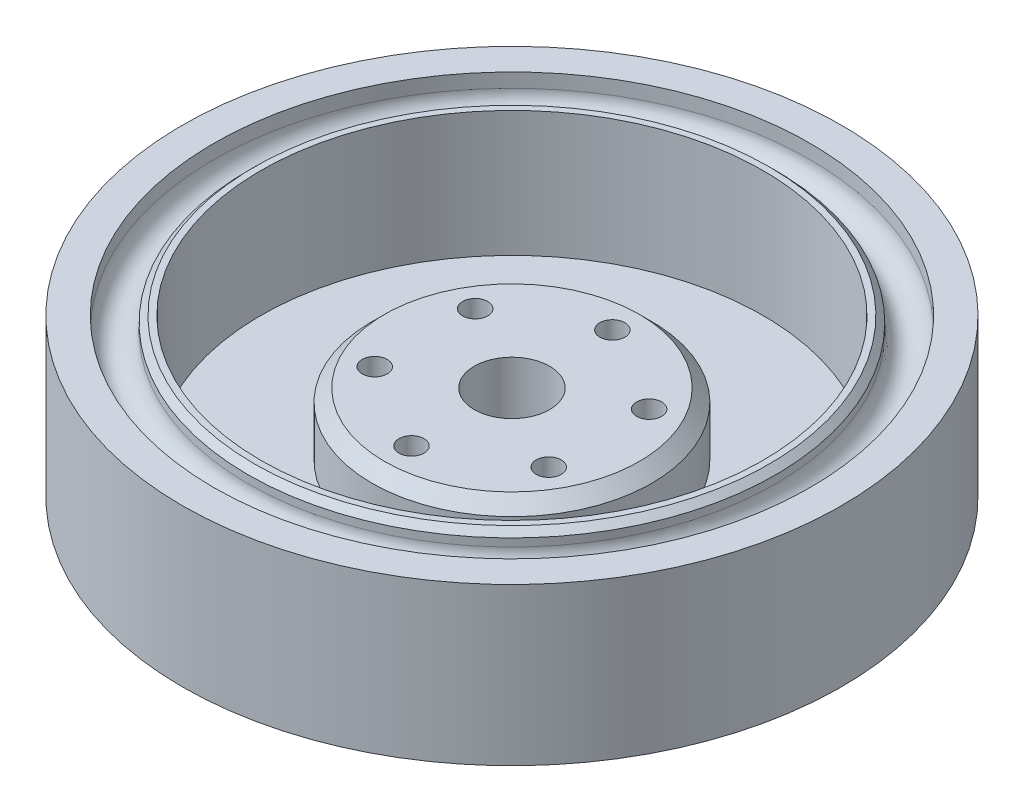
ISO-10303-21;
HEADER;
FILE_DESCRIPTION(('STEP AP214'),'2;1');
FILE_NAME('part.step','',(''),(''),'','','');
FILE_SCHEMA(('AUTOMOTIVE_DESIGN { 1 0 10303 214 1 1 1 1 }'));
ENDSEC;
DATA;
#1=APPLICATION_CONTEXT('core data for automotive mechanical design processes');
#2=APPLICATION_PROTOCOL_DEFINITION('international standard','automotive_design',2000,#1);
#3=PRODUCT_CONTEXT('',#1,'mechanical');
#4=PRODUCT('Part','Part','',(#3));
#5=PRODUCT_RELATED_PRODUCT_CATEGORY('part','',(#4));
#6=PRODUCT_DEFINITION_FORMATION('','',#4);
#7=PRODUCT_DEFINITION_CONTEXT('part definition',#1,'design');
#8=PRODUCT_DEFINITION('design','',#6,#7);
#9=PRODUCT_DEFINITION_SHAPE('','',#8);
#10=(LENGTH_UNIT() NAMED_UNIT(*) SI_UNIT(.MILLI.,.METRE.));
#11=(NAMED_UNIT(*) PLANE_ANGLE_UNIT() SI_UNIT($,.RADIAN.));
#12=(NAMED_UNIT(*) SI_UNIT($,.STERADIAN.) SOLID_ANGLE_UNIT());
#13=UNCERTAINTY_MEASURE_WITH_UNIT(LENGTH_MEASURE(1.E-05),#10,'distance_accuracy_value','');
#14=(GEOMETRIC_REPRESENTATION_CONTEXT(3) GLOBAL_UNCERTAINTY_ASSIGNED_CONTEXT((#13)) GLOBAL_UNIT_ASSIGNED_CONTEXT((#10,
#11,#12)) REPRESENTATION_CONTEXT('',''));
#15=CARTESIAN_POINT('',(0.,0.,0.));
#16=DIRECTION('',(0.,0.,1.));
#17=DIRECTION('',(1.,0.,0.));
#18=AXIS2_PLACEMENT_3D('',#15,#16,#17);
#19=CARTESIAN_POINT('',(-13.8564064605509,-0.000999999999999265,-8.00000000000016));
#20=DIRECTION('',(0.,1.,0.));
#21=DIRECTION('',(0.,0.,1.));
#22=AXIS2_PLACEMENT_3D('',#19,#20,#21);
#23=CYLINDRICAL_SURFACE('',#22,2.);
#24=CARTESIAN_POINT('',(-13.8564064605509,15.,-8.00000000000016));
#25=DIRECTION('',(0.,1.,0.));
#26=DIRECTION('',(0.,0.,1.));
#27=AXIS2_PLACEMENT_3D('',#24,#25,#26);
#28=CIRCLE('',#27,2.);
#29=CARTESIAN_POINT('',(-13.8564064605509,15.,-6.00000000000016));
#30=VERTEX_POINT('',#29);
#31=EDGE_CURVE('E79',#30,#30,#28,.T.);
#32=ORIENTED_EDGE('',*,*,#31,.T.);
#33=EDGE_LOOP('',(#32));
#34=FACE_BOUND('',#33,.T.);
#35=CARTESIAN_POINT('',(-13.8564064605509,5.,-8.00000000000016));
#36=DIRECTION('',(0.,-1.,0.));
#37=DIRECTION('',(0.,0.,-1.));
#38=AXIS2_PLACEMENT_3D('',#35,#36,#37);
#39=CIRCLE('',#38,2.);
#40=CARTESIAN_POINT('',(-13.8564064605509,5.,-10.0000000000002));
#41=VERTEX_POINT('',#40);
#42=EDGE_CURVE('E45',#41,#41,#39,.F.);
#43=ORIENTED_EDGE('',*,*,#42,.F.);
#44=EDGE_LOOP('',(#43));
#45=FACE_BOUND('',#44,.T.);
#46=ADVANCED_FACE('F40',(#34,#45),#23,.F.);
#47=CARTESIAN_POINT('',(-13.8564064605511,-0.000999999999999265,7.99999999999987));
#48=DIRECTION('',(0.,1.,0.));
#49=DIRECTION('',(0.,0.,1.));
#50=AXIS2_PLACEMENT_3D('',#47,#48,#49);
#51=CYLINDRICAL_SURFACE('',#50,2.);
#52=CARTESIAN_POINT('',(-13.8564064605511,15.,7.99999999999987));
#53=DIRECTION('',(0.,1.,0.));
#54=DIRECTION('',(0.,0.,1.));
#55=AXIS2_PLACEMENT_3D('',#52,#53,#54);
#56=CIRCLE('',#55,2.);
#57=CARTESIAN_POINT('',(-13.8564064605511,15.,9.99999999999987));
#58=VERTEX_POINT('',#57);
#59=EDGE_CURVE('E84',#58,#58,#56,.T.);
#60=ORIENTED_EDGE('',*,*,#59,.T.);
#61=EDGE_LOOP('',(#60));
#62=FACE_BOUND('',#61,.T.);
#63=CARTESIAN_POINT('',(-13.8564064605511,5.,7.99999999999987));
#64=DIRECTION('',(0.,-1.,0.));
#65=DIRECTION('',(0.,0.,-1.));
#66=AXIS2_PLACEMENT_3D('',#63,#64,#65);
#67=CIRCLE('',#66,2.);
#68=CARTESIAN_POINT('',(-13.8564064605511,5.,5.99999999999987));
#69=VERTEX_POINT('',#68);
#70=EDGE_CURVE('E70',#69,#69,#67,.F.);
#71=ORIENTED_EDGE('',*,*,#70,.F.);
#72=EDGE_LOOP('',(#71));
#73=FACE_BOUND('',#72,.T.);
#74=ADVANCED_FACE('F160',(#62,#73),#51,.F.);
#75=CARTESIAN_POINT('',(13.856406460551,-0.000999999999999265,-7.99999999999997));
#76=DIRECTION('',(0.,1.,0.));
#77=DIRECTION('',(0.,0.,1.));
#78=AXIS2_PLACEMENT_3D('',#75,#76,#77);
#79=CYLINDRICAL_SURFACE('',#78,2.);
#80=CARTESIAN_POINT('',(13.856406460551,15.,-7.99999999999997));
#81=DIRECTION('',(0.,1.,0.));
#82=DIRECTION('',(0.,0.,1.));
#83=AXIS2_PLACEMENT_3D('',#80,#81,#82);
#84=CIRCLE('',#83,2.);
#85=CARTESIAN_POINT('',(13.856406460551,15.,-5.99999999999997));
#86=VERTEX_POINT('',#85);
#87=EDGE_CURVE('E98',#86,#86,#84,.T.);
#88=ORIENTED_EDGE('',*,*,#87,.T.);
#89=EDGE_LOOP('',(#88));
#90=FACE_BOUND('',#89,.T.);
#91=CARTESIAN_POINT('',(13.856406460551,5.,-7.99999999999997));
#92=DIRECTION('',(0.,-1.,0.));
#93=DIRECTION('',(0.,0.,-1.));
#94=AXIS2_PLACEMENT_3D('',#91,#92,#93);
#95=CIRCLE('',#94,2.);
#96=CARTESIAN_POINT('',(13.856406460551,5.,-9.99999999999997));
#97=VERTEX_POINT('',#96);
#98=EDGE_CURVE('E68',#97,#97,#95,.F.);
#99=ORIENTED_EDGE('',*,*,#98,.F.);
#100=EDGE_LOOP('',(#99));
#101=FACE_BOUND('',#100,.T.);
#102=ADVANCED_FACE('F167',(#90,#101),#79,.F.);
#103=CARTESIAN_POINT('',(13.856406460551,-0.000999999999999265,8.00000000000007));
#104=DIRECTION('',(0.,1.,0.));
#105=DIRECTION('',(0.,0.,1.));
#106=AXIS2_PLACEMENT_3D('',#103,#104,#105);
#107=CYLINDRICAL_SURFACE('',#106,2.);
#108=CARTESIAN_POINT('',(13.856406460551,15.,8.00000000000007));
#109=DIRECTION('',(0.,1.,0.));
#110=DIRECTION('',(0.,0.,1.));
#111=AXIS2_PLACEMENT_3D('',#108,#109,#110);
#112=CIRCLE('',#111,2.);
#113=CARTESIAN_POINT('',(13.856406460551,15.,10.0000000000001));
#114=VERTEX_POINT('',#113);
#115=EDGE_CURVE('E95',#114,#114,#112,.T.);
#116=ORIENTED_EDGE('',*,*,#115,.T.);
#117=EDGE_LOOP('',(#116));
#118=FACE_BOUND('',#117,.T.);
#119=CARTESIAN_POINT('',(13.856406460551,5.,8.00000000000007));
#120=DIRECTION('',(0.,-1.,0.));
#121=DIRECTION('',(0.,0.,-1.));
#122=AXIS2_PLACEMENT_3D('',#119,#120,#121);
#123=CIRCLE('',#122,2.);
#124=CARTESIAN_POINT('',(13.856406460551,5.,6.00000000000006));
#125=VERTEX_POINT('',#124);
#126=EDGE_CURVE('E65',#125,#125,#123,.F.);
#127=ORIENTED_EDGE('',*,*,#126,.F.);
#128=EDGE_LOOP('',(#127));
#129=FACE_BOUND('',#128,.T.);
#130=ADVANCED_FACE('F227',(#118,#129),#107,.F.);
#131=CARTESIAN_POINT('',(-1.1172740284298E-13,-0.000999999999999265,16.));
#132=DIRECTION('',(0.,1.,0.));
#133=DIRECTION('',(0.,0.,1.));
#134=AXIS2_PLACEMENT_3D('',#131,#132,#133);
#135=CYLINDRICAL_SURFACE('',#134,2.);
#136=CARTESIAN_POINT('',(-1.1172740284298E-13,15.,16.));
#137=DIRECTION('',(0.,1.,0.));
#138=DIRECTION('',(0.,0.,1.));
#139=AXIS2_PLACEMENT_3D('',#136,#137,#138);
#140=CIRCLE('',#139,2.);
#141=CARTESIAN_POINT('',(-1.1172740284298E-13,15.,18.));
#142=VERTEX_POINT('',#141);
#143=EDGE_CURVE('E99',#142,#142,#140,.T.);
#144=ORIENTED_EDGE('',*,*,#143,.T.);
#145=EDGE_LOOP('',(#144));
#146=FACE_BOUND('',#145,.T.);
#147=CARTESIAN_POINT('',(-1.1172740284298E-13,5.,16.));
#148=DIRECTION('',(0.,-1.,0.));
#149=DIRECTION('',(0.,0.,-1.));
#150=AXIS2_PLACEMENT_3D('',#147,#148,#149);
#151=CIRCLE('',#150,2.);
#152=CARTESIAN_POINT('',(-1.1172740284298E-13,5.,14.));
#153=VERTEX_POINT('',#152);
#154=EDGE_CURVE('E61',#153,#153,#151,.F.);
#155=ORIENTED_EDGE('',*,*,#154,.F.);
#156=EDGE_LOOP('',(#155));
#157=FACE_BOUND('',#156,.T.);
#158=ADVANCED_FACE('F153',(#146,#157),#135,.F.);
#159=CARTESIAN_POINT('',(0.,-0.000999999999999265,-16.));
#160=DIRECTION('',(0.,1.,0.));
#161=DIRECTION('',(0.,0.,1.));
#162=AXIS2_PLACEMENT_3D('',#159,#160,#161);
#163=CYLINDRICAL_SURFACE('',#162,2.);
#164=CARTESIAN_POINT('',(0.,15.,-16.));
#165=DIRECTION('',(0.,1.,0.));
#166=DIRECTION('',(0.,0.,1.));
#167=AXIS2_PLACEMENT_3D('',#164,#165,#166);
#168=CIRCLE('',#167,2.);
#169=CARTESIAN_POINT('',(0.,15.,-14.));
#170=VERTEX_POINT('',#169);
#171=EDGE_CURVE('E90',#170,#170,#168,.T.);
#172=ORIENTED_EDGE('',*,*,#171,.T.);
#173=EDGE_LOOP('',(#172));
#174=FACE_BOUND('',#173,.T.);
#175=CARTESIAN_POINT('',(0.,5.,-16.));
#176=DIRECTION('',(0.,-1.,0.));
#177=DIRECTION('',(0.,0.,-1.));
#178=AXIS2_PLACEMENT_3D('',#175,#176,#177);
#179=CIRCLE('',#178,2.);
#180=CARTESIAN_POINT('',(0.,5.,-18.));
#181=VERTEX_POINT('',#180);
#182=EDGE_CURVE('E58',#181,#181,#179,.F.);
#183=ORIENTED_EDGE('',*,*,#182,.F.);
#184=EDGE_LOOP('',(#183));
#185=FACE_BOUND('',#184,.T.);
#186=ADVANCED_FACE('F141',(#174,#185),#163,.F.);
#187=CARTESIAN_POINT('',(0.,22.75,0.));
#188=DIRECTION('',(0.,1.,0.));
#189=DIRECTION('',(0.,0.,1.));
#190=AXIS2_PLACEMENT_3D('',#187,#188,#189);
#191=TOROIDAL_SURFACE('',#190,44.75,2.75);
#192=CARTESIAN_POINT('',(0.,22.75,0.));
#193=DIRECTION('',(0.,1.,0.));
#194=DIRECTION('',(0.,0.,1.));
#195=AXIS2_PLACEMENT_3D('',#192,#193,#194);
#196=CIRCLE('',#195,42.);
#197=CARTESIAN_POINT('',(0.,22.75,42.));
#198=VERTEX_POINT('',#197);
#199=EDGE_CURVE('E131',#198,#198,#196,.T.);
#200=ORIENTED_EDGE('',*,*,#199,.F.);
#201=EDGE_LOOP('',(#200));
#202=FACE_BOUND('',#201,.T.);
#203=CARTESIAN_POINT('',(0.,22.75,0.));
#204=DIRECTION('',(0.,1.,0.));
#205=DIRECTION('',(0.,0.,1.));
#206=AXIS2_PLACEMENT_3D('',#203,#204,#205);
#207=CIRCLE('',#206,47.5);
#208=CARTESIAN_POINT('',(0.,22.75,47.5));
#209=VERTEX_POINT('',#208);
#210=EDGE_CURVE('E54',#209,#209,#207,.F.);
#211=ORIENTED_EDGE('',*,*,#210,.F.);
#212=EDGE_LOOP('',(#211));
#213=FACE_BOUND('',#212,.T.);
#214=ADVANCED_FACE('F138',(#202,#213),#191,.F.);
#215=CARTESIAN_POINT('',(0.,25.,0.));
#216=DIRECTION('',(0.,1.,0.));
#217=DIRECTION('',(0.,0.,1.));
#218=AXIS2_PLACEMENT_3D('',#215,#216,#217);
#219=PLANE('',#218);
#220=CARTESIAN_POINT('',(0.,25.,0.));
#221=DIRECTION('',(0.,1.,0.));
#222=DIRECTION('',(0.,0.,1.));
#223=AXIS2_PLACEMENT_3D('',#220,#221,#222);
#224=CIRCLE('',#223,41.);
#225=CARTESIAN_POINT('',(0.,25.,41.));
#226=VERTEX_POINT('',#225);
#227=EDGE_CURVE('E49',#226,#226,#224,.T.);
#228=ORIENTED_EDGE('',*,*,#227,.T.);
#229=EDGE_LOOP('',(#228));
#230=FACE_BOUND('',#229,.T.);
#231=CARTESIAN_POINT('',(0.,25.,0.));
#232=DIRECTION('',(0.,1.,0.));
#233=DIRECTION('',(0.,0.,1.));
#234=AXIS2_PLACEMENT_3D('',#231,#232,#233);
#235=CIRCLE('',#234,40.);
#236=CARTESIAN_POINT('',(0.,25.,40.));
#237=VERTEX_POINT('',#236);
#238=EDGE_CURVE('E113',#237,#237,#235,.T.);
#239=ORIENTED_EDGE('',*,*,#238,.F.);
#240=EDGE_LOOP('',(#239));
#241=FACE_BOUND('',#240,.T.);
#242=ADVANCED_FACE('F140',(#230,#241),#219,.T.);
#243=CARTESIAN_POINT('',(0.,25.,0.));
#244=DIRECTION('',(0.,-1.,0.));
#245=DIRECTION('',(0.,0.,-1.));
#246=AXIS2_PLACEMENT_3D('',#243,#244,#245);
#247=CYLINDRICAL_SURFACE('',#246,52.5);
#248=CARTESIAN_POINT('',(0.,25.,0.));
#249=DIRECTION('',(0.,1.,0.));
#250=DIRECTION('',(0.,0.,1.));
#251=AXIS2_PLACEMENT_3D('',#248,#249,#250);
#252=CIRCLE('',#251,52.5);
#253=CARTESIAN_POINT('',(0.,25.,52.5));
#254=VERTEX_POINT('',#253);
#255=EDGE_CURVE('E120',#254,#254,#252,.T.);
#256=ORIENTED_EDGE('',*,*,#255,.F.);
#257=EDGE_LOOP('',(#256));
#258=FACE_BOUND('',#257,.T.);
#259=CARTESIAN_POINT('',(0.,0.,0.));
#260=DIRECTION('',(0.,1.,0.));
#261=DIRECTION('',(0.,0.,1.));
#262=AXIS2_PLACEMENT_3D('',#259,#260,#261);
#263=CIRCLE('',#262,52.5);
#264=CARTESIAN_POINT('',(0.,0.,52.5));
#265=VERTEX_POINT('',#264);
#266=EDGE_CURVE('E117',#265,#265,#263,.T.);
#267=ORIENTED_EDGE('',*,*,#266,.T.);
#268=EDGE_LOOP('',(#267));
#269=FACE_BOUND('',#268,.T.);
#270=ADVANCED_FACE('F148',(#258,#269),#247,.T.);
#271=CARTESIAN_POINT('',(0.,25.,0.));
#272=DIRECTION('',(0.,1.,0.));
#273=DIRECTION('',(0.,0.,1.));
#274=AXIS2_PLACEMENT_3D('',#271,#272,#273);
#275=CIRCLE('',#274,47.5);
#276=CARTESIAN_POINT('',(0.,25.,47.5));
#277=VERTEX_POINT('',#276);
#278=EDGE_CURVE('E75',#277,#277,#275,.T.);
#279=ORIENTED_EDGE('',*,*,#278,.F.);
#280=EDGE_LOOP('',(#279));
#281=FACE_BOUND('',#280,.T.);
#282=ORIENTED_EDGE('',*,*,#255,.T.);
#283=EDGE_LOOP('',(#282));
#284=FACE_BOUND('',#283,.T.);
#285=ADVANCED_FACE('F151',(#281,#284),#219,.T.);
#286=CARTESIAN_POINT('',(0.,0.,0.));
#287=DIRECTION('',(0.,1.,0.));
#288=DIRECTION('',(0.,0.,1.));
#289=AXIS2_PLACEMENT_3D('',#286,#287,#288);
#290=PLANE('',#289);
#291=CARTESIAN_POINT('',(13.856406460551,0.,7.99999999999997));
#292=DIRECTION('',(0.,-1.,0.));
#293=DIRECTION('',(0.,0.,-1.));
#294=AXIS2_PLACEMENT_3D('',#291,#292,#293);
#295=CIRCLE('',#294,5.);
#296=CARTESIAN_POINT('',(13.856406460551,0.,2.99999999999997));
#297=VERTEX_POINT('',#296);
#298=EDGE_CURVE('E420',#297,#297,#295,.T.);
#299=ORIENTED_EDGE('',*,*,#298,.F.);
#300=EDGE_LOOP('',(#299));
#301=FACE_BOUND('',#300,.T.);
#302=CARTESIAN_POINT('',(13.856406460551,0.,-8.00000000000007));
#303=DIRECTION('',(0.,-1.,0.));
#304=DIRECTION('',(0.,0.,-1.));
#305=AXIS2_PLACEMENT_3D('',#302,#303,#304);
#306=CIRCLE('',#305,5.);
#307=CARTESIAN_POINT('',(13.856406460551,0.,-13.0000000000001));
#308=VERTEX_POINT('',#307);
#309=EDGE_CURVE('E426',#308,#308,#306,.T.);
#310=ORIENTED_EDGE('',*,*,#309,.F.);
#311=EDGE_LOOP('',(#310));
#312=FACE_BOUND('',#311,.T.);
#313=CARTESIAN_POINT('',(-1.1303467229697E-13,0.,-16.));
#314=DIRECTION('',(0.,-1.,0.));
#315=DIRECTION('',(0.,0.,-1.));
#316=AXIS2_PLACEMENT_3D('',#313,#314,#315);
#317=CIRCLE('',#316,5.);
#318=CARTESIAN_POINT('',(-1.1303467229697E-13,0.,-21.));
#319=VERTEX_POINT('',#318);
#320=EDGE_CURVE('E431',#319,#319,#317,.T.);
#321=ORIENTED_EDGE('',*,*,#320,.F.);
#322=EDGE_LOOP('',(#321));
#323=FACE_BOUND('',#322,.T.);
#324=CARTESIAN_POINT('',(-13.8564064605511,0.,-7.99999999999987));
#325=DIRECTION('',(0.,-1.,0.));
#326=DIRECTION('',(0.,0.,-1.));
#327=AXIS2_PLACEMENT_3D('',#324,#325,#326);
#328=CIRCLE('',#327,5.);
#329=CARTESIAN_POINT('',(-13.8564064605511,0.,-12.9999999999999));
#330=VERTEX_POINT('',#329);
#331=EDGE_CURVE('E416',#330,#330,#328,.T.);
#332=ORIENTED_EDGE('',*,*,#331,.F.);
#333=EDGE_LOOP('',(#332));
#334=FACE_BOUND('',#333,.T.);
#335=CARTESIAN_POINT('',(-13.8564064605509,0.,8.00000000000016));
#336=DIRECTION('',(0.,-1.,0.));
#337=DIRECTION('',(0.,0.,-1.));
#338=AXIS2_PLACEMENT_3D('',#335,#336,#337);
#339=CIRCLE('',#338,5.);
#340=CARTESIAN_POINT('',(-13.8564064605509,0.,3.00000000000016));
#341=VERTEX_POINT('',#340);
#342=EDGE_CURVE('E411',#341,#341,#339,.T.);
#343=ORIENTED_EDGE('',*,*,#342,.F.);
#344=EDGE_LOOP('',(#343));
#345=FACE_BOUND('',#344,.T.);
#346=CARTESIAN_POINT('',(0.,0.,16.));
#347=DIRECTION('',(0.,-1.,0.));
#348=DIRECTION('',(0.,0.,-1.));
#349=AXIS2_PLACEMENT_3D('',#346,#347,#348);
#350=CIRCLE('',#349,5.);
#351=CARTESIAN_POINT('',(0.,0.,11.));
#352=VERTEX_POINT('',#351);
#353=EDGE_CURVE('E88',#352,#352,#350,.T.);
#354=ORIENTED_EDGE('',*,*,#353,.F.);
#355=EDGE_LOOP('',(#354));
#356=FACE_BOUND('',#355,.T.);
#357=CARTESIAN_POINT('',(0.,0.,0.));
#358=DIRECTION('',(0.,1.,0.));
#359=DIRECTION('',(0.,0.,1.));
#360=AXIS2_PLACEMENT_3D('',#357,#358,#359);
#361=CIRCLE('',#360,6.);
#362=CARTESIAN_POINT('',(0.,0.,6.));
#363=VERTEX_POINT('',#362);
#364=EDGE_CURVE('E102',#363,#363,#361,.F.);
#365=ORIENTED_EDGE('',*,*,#364,.F.);
#366=EDGE_LOOP('',(#365));
#367=FACE_BOUND('',#366,.T.);
#368=ORIENTED_EDGE('',*,*,#266,.F.);
#369=EDGE_LOOP('',(#368));
#370=FACE_BOUND('',#369,.T.);
#371=ADVANCED_FACE('F188',(#301,#312,#323,#334,#345,#356,#367,#370),#290,.F.);
#372=CARTESIAN_POINT('',(0.,5.,0.));
#373=DIRECTION('',(0.,1.,0.));
#374=DIRECTION('',(0.,0.,1.));
#375=AXIS2_PLACEMENT_3D('',#372,#373,#374);
#376=CYLINDRICAL_SURFACE('',#375,40.);
#377=CARTESIAN_POINT('',(0.,5.,0.));
#378=DIRECTION('',(0.,1.,0.));
#379=DIRECTION('',(0.,0.,1.));
#380=AXIS2_PLACEMENT_3D('',#377,#378,#379);
#381=CIRCLE('',#380,40.);
#382=CARTESIAN_POINT('',(0.,5.,40.));
#383=VERTEX_POINT('',#382);
#384=EDGE_CURVE('E114',#383,#383,#381,.T.);
#385=ORIENTED_EDGE('',*,*,#384,.F.);
#386=EDGE_LOOP('',(#385));
#387=FACE_BOUND('',#386,.T.);
#388=ORIENTED_EDGE('',*,*,#238,.T.);
#389=EDGE_LOOP('',(#388));
#390=FACE_BOUND('',#389,.T.);
#391=ADVANCED_FACE('F185',(#387,#390),#376,.F.);
#392=CARTESIAN_POINT('',(0.,5.,0.));
#393=DIRECTION('',(0.,1.,0.));
#394=DIRECTION('',(0.,0.,1.));
#395=AXIS2_PLACEMENT_3D('',#392,#393,#394);
#396=PLANE('',#395);
#397=CARTESIAN_POINT('',(0.,5.,0.));
#398=DIRECTION('',(0.,1.,0.));
#399=DIRECTION('',(0.,0.,1.));
#400=AXIS2_PLACEMENT_3D('',#397,#398,#399);
#401=CIRCLE('',#400,22.3);
#402=CARTESIAN_POINT('',(0.,5.,22.3));
#403=VERTEX_POINT('',#402);
#404=EDGE_CURVE('E93',#403,#403,#401,.T.);
#405=ORIENTED_EDGE('',*,*,#404,.F.);
#406=EDGE_LOOP('',(#405));
#407=FACE_BOUND('',#406,.T.);
#408=ORIENTED_EDGE('',*,*,#384,.T.);
#409=EDGE_LOOP('',(#408));
#410=FACE_BOUND('',#409,.T.);
#411=ADVANCED_FACE('F181',(#407,#410),#396,.T.);
#412=CARTESIAN_POINT('',(0.,15.,0.));
#413=DIRECTION('',(0.,-1.,0.));
#414=DIRECTION('',(0.,0.,-1.));
#415=AXIS2_PLACEMENT_3D('',#412,#413,#414);
#416=CYLINDRICAL_SURFACE('',#415,22.3);
#417=CARTESIAN_POINT('',(0.,13.,0.));
#418=DIRECTION('',(0.,1.,0.));
#419=DIRECTION('',(0.,0.,1.));
#420=AXIS2_PLACEMENT_3D('',#417,#418,#419);
#421=CIRCLE('',#420,22.3);
#422=CARTESIAN_POINT('',(0.,13.,22.3));
#423=VERTEX_POINT('',#422);
#424=EDGE_CURVE('E128',#423,#423,#421,.F.);
#425=ORIENTED_EDGE('',*,*,#424,.T.);
#426=EDGE_LOOP('',(#425));
#427=FACE_BOUND('',#426,.T.);
#428=ORIENTED_EDGE('',*,*,#404,.T.);
#429=EDGE_LOOP('',(#428));
#430=FACE_BOUND('',#429,.T.);
#431=ADVANCED_FACE('F177',(#427,#430),#416,.T.);
#432=CARTESIAN_POINT('',(0.,15.,0.));
#433=DIRECTION('',(0.,1.,0.));
#434=DIRECTION('',(0.,0.,1.));
#435=AXIS2_PLACEMENT_3D('',#432,#433,#434);
#436=PLANE('',#435);
#437=ORIENTED_EDGE('',*,*,#171,.F.);
#438=EDGE_LOOP('',(#437));
#439=FACE_BOUND('',#438,.T.);
#440=ORIENTED_EDGE('',*,*,#143,.F.);
#441=EDGE_LOOP('',(#440));
#442=FACE_BOUND('',#441,.T.);
#443=ORIENTED_EDGE('',*,*,#115,.F.);
#444=EDGE_LOOP('',(#443));
#445=FACE_BOUND('',#444,.T.);
#446=ORIENTED_EDGE('',*,*,#87,.F.);
#447=EDGE_LOOP('',(#446));
#448=FACE_BOUND('',#447,.T.);
#449=CARTESIAN_POINT('',(0.,15.,0.));
#450=DIRECTION('',(0.,1.,0.));
#451=DIRECTION('',(0.,0.,1.));
#452=AXIS2_PLACEMENT_3D('',#449,#450,#451);
#453=CIRCLE('',#452,6.);
#454=CARTESIAN_POINT('',(0.,15.,6.));
#455=VERTEX_POINT('',#454);
#456=EDGE_CURVE('E94',#455,#455,#453,.T.);
#457=ORIENTED_EDGE('',*,*,#456,.F.);
#458=EDGE_LOOP('',(#457));
#459=FACE_BOUND('',#458,.T.);
#460=ORIENTED_EDGE('',*,*,#59,.F.);
#461=EDGE_LOOP('',(#460));
#462=FACE_BOUND('',#461,.T.);
#463=ORIENTED_EDGE('',*,*,#31,.F.);
#464=EDGE_LOOP('',(#463));
#465=FACE_BOUND('',#464,.T.);
#466=CARTESIAN_POINT('',(0.,15.,0.));
#467=DIRECTION('',(0.,1.,0.));
#468=DIRECTION('',(0.,0.,1.));
#469=AXIS2_PLACEMENT_3D('',#466,#467,#468);
#470=CIRCLE('',#469,20.3);
#471=CARTESIAN_POINT('',(0.,15.,20.3));
#472=VERTEX_POINT('',#471);
#473=EDGE_CURVE('E123',#472,#472,#470,.T.);
#474=ORIENTED_EDGE('',*,*,#473,.T.);
#475=EDGE_LOOP('',(#474));
#476=FACE_BOUND('',#475,.T.);
#477=ADVANCED_FACE('F173',(#439,#442,#445,#448,#459,#462,#465,#476),#436,.T.);
#478=CARTESIAN_POINT('',(0.,15.,0.));
#479=DIRECTION('',(0.,-1.,0.));
#480=DIRECTION('',(0.,0.,-1.));
#481=AXIS2_PLACEMENT_3D('',#478,#479,#480);
#482=CONICAL_SURFACE('',#481,20.3,0.785398163397447);
#483=ORIENTED_EDGE('',*,*,#424,.F.);
#484=EDGE_LOOP('',(#483));
#485=FACE_BOUND('',#484,.T.);
#486=ORIENTED_EDGE('',*,*,#473,.F.);
#487=EDGE_LOOP('',(#486));
#488=FACE_BOUND('',#487,.T.);
#489=ADVANCED_FACE('F176',(#485,#488),#482,.T.);
#490=CARTESIAN_POINT('',(0.,-0.000999999999999265,0.));
#491=DIRECTION('',(0.,1.,0.));
#492=DIRECTION('',(0.,0.,1.));
#493=AXIS2_PLACEMENT_3D('',#490,#491,#492);
#494=CYLINDRICAL_SURFACE('',#493,6.);
#495=ORIENTED_EDGE('',*,*,#456,.T.);
#496=EDGE_LOOP('',(#495));
#497=FACE_BOUND('',#496,.T.);
#498=ORIENTED_EDGE('',*,*,#364,.T.);
#499=EDGE_LOOP('',(#498));
#500=FACE_BOUND('',#499,.T.);
#501=ADVANCED_FACE('F201',(#497,#500),#494,.F.);
#502=CARTESIAN_POINT('',(0.,20.,0.));
#503=DIRECTION('',(0.,1.,0.));
#504=DIRECTION('',(0.,0.,1.));
#505=AXIS2_PLACEMENT_3D('',#502,#503,#504);
#506=CYLINDRICAL_SURFACE('',#505,47.5);
#507=ORIENTED_EDGE('',*,*,#210,.T.);
#508=EDGE_LOOP('',(#507));
#509=FACE_BOUND('',#508,.T.);
#510=ORIENTED_EDGE('',*,*,#278,.T.);
#511=EDGE_LOOP('',(#510));
#512=FACE_BOUND('',#511,.T.);
#513=ADVANCED_FACE('F136',(#509,#512),#506,.F.);
#514=CARTESIAN_POINT('',(0.,20.,0.));
#515=DIRECTION('',(0.,1.,0.));
#516=DIRECTION('',(0.,0.,1.));
#517=AXIS2_PLACEMENT_3D('',#514,#515,#516);
#518=CYLINDRICAL_SURFACE('',#517,42.);
#519=CARTESIAN_POINT('',(0.,24.,0.));
#520=DIRECTION('',(0.,1.,0.));
#521=DIRECTION('',(0.,0.,1.));
#522=AXIS2_PLACEMENT_3D('',#519,#520,#521);
#523=CIRCLE('',#522,42.);
#524=CARTESIAN_POINT('',(0.,24.,42.));
#525=VERTEX_POINT('',#524);
#526=EDGE_CURVE('E10',#525,#525,#523,.F.);
#527=ORIENTED_EDGE('',*,*,#526,.T.);
#528=EDGE_LOOP('',(#527));
#529=FACE_BOUND('',#528,.T.);
#530=ORIENTED_EDGE('',*,*,#199,.T.);
#531=EDGE_LOOP('',(#530));
#532=FACE_BOUND('',#531,.T.);
#533=ADVANCED_FACE('F221',(#529,#532),#518,.T.);
#534=CARTESIAN_POINT('',(0.,25.,0.));
#535=DIRECTION('',(0.,-1.,0.));
#536=DIRECTION('',(0.,0.,-1.));
#537=AXIS2_PLACEMENT_3D('',#534,#535,#536);
#538=CONICAL_SURFACE('',#537,41.,0.785398163397441);
#539=ORIENTED_EDGE('',*,*,#526,.F.);
#540=EDGE_LOOP('',(#539));
#541=FACE_BOUND('',#540,.T.);
#542=ORIENTED_EDGE('',*,*,#227,.F.);
#543=EDGE_LOOP('',(#542));
#544=FACE_BOUND('',#543,.T.);
#545=ADVANCED_FACE('F43',(#541,#544),#538,.T.);
#546=CARTESIAN_POINT('',(-1.1303467229697E-13,5.,-16.));
#547=DIRECTION('',(0.,-1.,0.));
#548=DIRECTION('',(0.,0.,-1.));
#549=AXIS2_PLACEMENT_3D('',#546,#547,#548);
#550=PLANE('',#549);
#551=CARTESIAN_POINT('',(-1.1303467229697E-13,5.,-16.));
#552=DIRECTION('',(0.,-1.,0.));
#553=DIRECTION('',(0.,0.,-1.));
#554=AXIS2_PLACEMENT_3D('',#551,#552,#553);
#555=CIRCLE('',#554,5.);
#556=CARTESIAN_POINT('',(-1.1303467229697E-13,5.,-21.));
#557=VERTEX_POINT('',#556);
#558=EDGE_CURVE('E434',#557,#557,#555,.T.);
#559=ORIENTED_EDGE('',*,*,#558,.T.);
#560=EDGE_LOOP('',(#559));
#561=FACE_BOUND('',#560,.T.);
#562=ORIENTED_EDGE('',*,*,#182,.T.);
#563=EDGE_LOOP('',(#562));
#564=FACE_BOUND('',#563,.T.);
#565=ADVANCED_FACE('F260',(#561,#564),#550,.T.);
#566=CARTESIAN_POINT('',(-1.1303467229697E-13,5.,-16.));
#567=DIRECTION('',(0.,-1.,0.));
#568=DIRECTION('',(0.,0.,-1.));
#569=AXIS2_PLACEMENT_3D('',#566,#567,#568);
#570=CYLINDRICAL_SURFACE('',#569,5.);
#571=ORIENTED_EDGE('',*,*,#558,.F.);
#572=EDGE_LOOP('',(#571));
#573=FACE_BOUND('',#572,.T.);
#574=ORIENTED_EDGE('',*,*,#320,.T.);
#575=EDGE_LOOP('',(#574));
#576=FACE_BOUND('',#575,.T.);
#577=ADVANCED_FACE('F256',(#573,#576),#570,.F.);
#578=CARTESIAN_POINT('',(0.,5.,16.));
#579=DIRECTION('',(0.,-1.,0.));
#580=DIRECTION('',(0.,0.,-1.));
#581=AXIS2_PLACEMENT_3D('',#578,#579,#580);
#582=PLANE('',#581);
#583=CARTESIAN_POINT('',(0.,5.,16.));
#584=DIRECTION('',(0.,-1.,0.));
#585=DIRECTION('',(0.,0.,-1.));
#586=AXIS2_PLACEMENT_3D('',#583,#584,#585);
#587=CIRCLE('',#586,5.);
#588=CARTESIAN_POINT('',(0.,5.,11.));
#589=VERTEX_POINT('',#588);
#590=EDGE_CURVE('E62',#589,#589,#587,.T.);
#591=ORIENTED_EDGE('',*,*,#590,.T.);
#592=EDGE_LOOP('',(#591));
#593=FACE_BOUND('',#592,.T.);
#594=ORIENTED_EDGE('',*,*,#154,.T.);
#595=EDGE_LOOP('',(#594));
#596=FACE_BOUND('',#595,.T.);
#597=ADVANCED_FACE('F259',(#593,#596),#582,.T.);
#598=CARTESIAN_POINT('',(0.,5.,16.));
#599=DIRECTION('',(0.,-1.,0.));
#600=DIRECTION('',(0.,0.,-1.));
#601=AXIS2_PLACEMENT_3D('',#598,#599,#600);
#602=CYLINDRICAL_SURFACE('',#601,5.);
#603=ORIENTED_EDGE('',*,*,#590,.F.);
#604=EDGE_LOOP('',(#603));
#605=FACE_BOUND('',#604,.T.);
#606=ORIENTED_EDGE('',*,*,#353,.T.);
#607=EDGE_LOOP('',(#606));
#608=FACE_BOUND('',#607,.T.);
#609=ADVANCED_FACE('F276',(#605,#608),#602,.F.);
#610=CARTESIAN_POINT('',(13.856406460551,5.,7.99999999999997));
#611=DIRECTION('',(0.,-1.,0.));
#612=DIRECTION('',(0.,0.,-1.));
#613=AXIS2_PLACEMENT_3D('',#610,#611,#612);
#614=PLANE('',#613);
#615=CARTESIAN_POINT('',(13.856406460551,5.,7.99999999999997));
#616=DIRECTION('',(0.,-1.,0.));
#617=DIRECTION('',(0.,0.,-1.));
#618=AXIS2_PLACEMENT_3D('',#615,#616,#617);
#619=CIRCLE('',#618,5.);
#620=CARTESIAN_POINT('',(13.856406460551,5.,2.99999999999997));
#621=VERTEX_POINT('',#620);
#622=EDGE_CURVE('E423',#621,#621,#619,.T.);
#623=ORIENTED_EDGE('',*,*,#622,.T.);
#624=EDGE_LOOP('',(#623));
#625=FACE_BOUND('',#624,.T.);
#626=ORIENTED_EDGE('',*,*,#126,.T.);
#627=EDGE_LOOP('',(#626));
#628=FACE_BOUND('',#627,.T.);
#629=ADVANCED_FACE('F250',(#625,#628),#614,.T.);
#630=CARTESIAN_POINT('',(13.856406460551,5.,7.99999999999997));
#631=DIRECTION('',(0.,-1.,0.));
#632=DIRECTION('',(0.,0.,-1.));
#633=AXIS2_PLACEMENT_3D('',#630,#631,#632);
#634=CYLINDRICAL_SURFACE('',#633,5.);
#635=ORIENTED_EDGE('',*,*,#622,.F.);
#636=EDGE_LOOP('',(#635));
#637=FACE_BOUND('',#636,.T.);
#638=ORIENTED_EDGE('',*,*,#298,.T.);
#639=EDGE_LOOP('',(#638));
#640=FACE_BOUND('',#639,.T.);
#641=ADVANCED_FACE('F240',(#637,#640),#634,.F.);
#642=CARTESIAN_POINT('',(13.856406460551,5.,-8.00000000000007));
#643=DIRECTION('',(0.,-1.,0.));
#644=DIRECTION('',(0.,0.,-1.));
#645=AXIS2_PLACEMENT_3D('',#642,#643,#644);
#646=PLANE('',#645);
#647=CARTESIAN_POINT('',(13.856406460551,5.,-8.00000000000007));
#648=DIRECTION('',(0.,-1.,0.));
#649=DIRECTION('',(0.,0.,-1.));
#650=AXIS2_PLACEMENT_3D('',#647,#648,#649);
#651=CIRCLE('',#650,5.);
#652=CARTESIAN_POINT('',(13.856406460551,5.,-13.0000000000001));
#653=VERTEX_POINT('',#652);
#654=EDGE_CURVE('E429',#653,#653,#651,.T.);
#655=ORIENTED_EDGE('',*,*,#654,.T.);
#656=EDGE_LOOP('',(#655));
#657=FACE_BOUND('',#656,.T.);
#658=ORIENTED_EDGE('',*,*,#98,.T.);
#659=EDGE_LOOP('',(#658));
#660=FACE_BOUND('',#659,.T.);
#661=ADVANCED_FACE('F237',(#657,#660),#646,.T.);
#662=CARTESIAN_POINT('',(13.856406460551,5.,-8.00000000000007));
#663=DIRECTION('',(0.,-1.,0.));
#664=DIRECTION('',(0.,0.,-1.));
#665=AXIS2_PLACEMENT_3D('',#662,#663,#664);
#666=CYLINDRICAL_SURFACE('',#665,5.);
#667=ORIENTED_EDGE('',*,*,#654,.F.);
#668=EDGE_LOOP('',(#667));
#669=FACE_BOUND('',#668,.T.);
#670=ORIENTED_EDGE('',*,*,#309,.T.);
#671=EDGE_LOOP('',(#670));
#672=FACE_BOUND('',#671,.T.);
#673=ADVANCED_FACE('F239',(#669,#672),#666,.F.);
#674=CARTESIAN_POINT('',(-13.8564064605509,5.,8.00000000000016));
#675=DIRECTION('',(0.,-1.,0.));
#676=DIRECTION('',(0.,0.,-1.));
#677=AXIS2_PLACEMENT_3D('',#674,#675,#676);
#678=PLANE('',#677);
#679=CARTESIAN_POINT('',(-13.8564064605509,5.,8.00000000000016));
#680=DIRECTION('',(0.,-1.,0.));
#681=DIRECTION('',(0.,0.,-1.));
#682=AXIS2_PLACEMENT_3D('',#679,#680,#681);
#683=CIRCLE('',#682,5.);
#684=CARTESIAN_POINT('',(-13.8564064605509,5.,3.00000000000016));
#685=VERTEX_POINT('',#684);
#686=EDGE_CURVE('E408',#685,#685,#683,.T.);
#687=ORIENTED_EDGE('',*,*,#686,.T.);
#688=EDGE_LOOP('',(#687));
#689=FACE_BOUND('',#688,.T.);
#690=ORIENTED_EDGE('',*,*,#70,.T.);
#691=EDGE_LOOP('',(#690));
#692=FACE_BOUND('',#691,.T.);
#693=ADVANCED_FACE('F247',(#689,#692),#678,.T.);
#694=CARTESIAN_POINT('',(-13.8564064605509,5.,8.00000000000016));
#695=DIRECTION('',(0.,-1.,0.));
#696=DIRECTION('',(0.,0.,-1.));
#697=AXIS2_PLACEMENT_3D('',#694,#695,#696);
#698=CYLINDRICAL_SURFACE('',#697,5.);
#699=ORIENTED_EDGE('',*,*,#686,.F.);
#700=EDGE_LOOP('',(#699));
#701=FACE_BOUND('',#700,.T.);
#702=ORIENTED_EDGE('',*,*,#342,.T.);
#703=EDGE_LOOP('',(#702));
#704=FACE_BOUND('',#703,.T.);
#705=ADVANCED_FACE('F272',(#701,#704),#698,.F.);
#706=CARTESIAN_POINT('',(-13.8564064605511,5.,-7.99999999999987));
#707=DIRECTION('',(0.,-1.,0.));
#708=DIRECTION('',(0.,0.,-1.));
#709=AXIS2_PLACEMENT_3D('',#706,#707,#708);
#710=PLANE('',#709);
#711=CARTESIAN_POINT('',(-13.8564064605511,5.,-7.99999999999987));
#712=DIRECTION('',(0.,-1.,0.));
#713=DIRECTION('',(0.,0.,-1.));
#714=AXIS2_PLACEMENT_3D('',#711,#712,#713);
#715=CIRCLE('',#714,5.);
#716=CARTESIAN_POINT('',(-13.8564064605511,5.,-12.9999999999999));
#717=VERTEX_POINT('',#716);
#718=EDGE_CURVE('E413',#717,#717,#715,.T.);
#719=ORIENTED_EDGE('',*,*,#718,.T.);
#720=EDGE_LOOP('',(#719));
#721=FACE_BOUND('',#720,.T.);
#722=ORIENTED_EDGE('',*,*,#42,.T.);
#723=EDGE_LOOP('',(#722));
#724=FACE_BOUND('',#723,.T.);
#725=ADVANCED_FACE('F268',(#721,#724),#710,.T.);
#726=CARTESIAN_POINT('',(-13.8564064605511,5.,-7.99999999999987));
#727=DIRECTION('',(0.,-1.,0.));
#728=DIRECTION('',(0.,0.,-1.));
#729=AXIS2_PLACEMENT_3D('',#726,#727,#728);
#730=CYLINDRICAL_SURFACE('',#729,5.);
#731=ORIENTED_EDGE('',*,*,#718,.F.);
#732=EDGE_LOOP('',(#731));
#733=FACE_BOUND('',#732,.T.);
#734=ORIENTED_EDGE('',*,*,#331,.T.);
#735=EDGE_LOOP('',(#734));
#736=FACE_BOUND('',#735,.T.);
#737=ADVANCED_FACE('F265',(#733,#736),#730,.F.);
#738=CLOSED_SHELL('',(#46,#74,#102,#130,#158,#186,#214,#242,#270,#285,#371,#391,#411,#431,#477,
#489,#501,#513,#533,#545,#565,#577,#597,#609,#629,#641,#661,#673,#693,#705,#725,#737));
#739=MANIFOLD_SOLID_BREP('B2',#738);
#740=ADVANCED_BREP_SHAPE_REPRESENTATION('',(#18,#739),#14);
#741=SHAPE_DEFINITION_REPRESENTATION(#9,#740);
ENDSEC;
END-ISO-10303-21;
